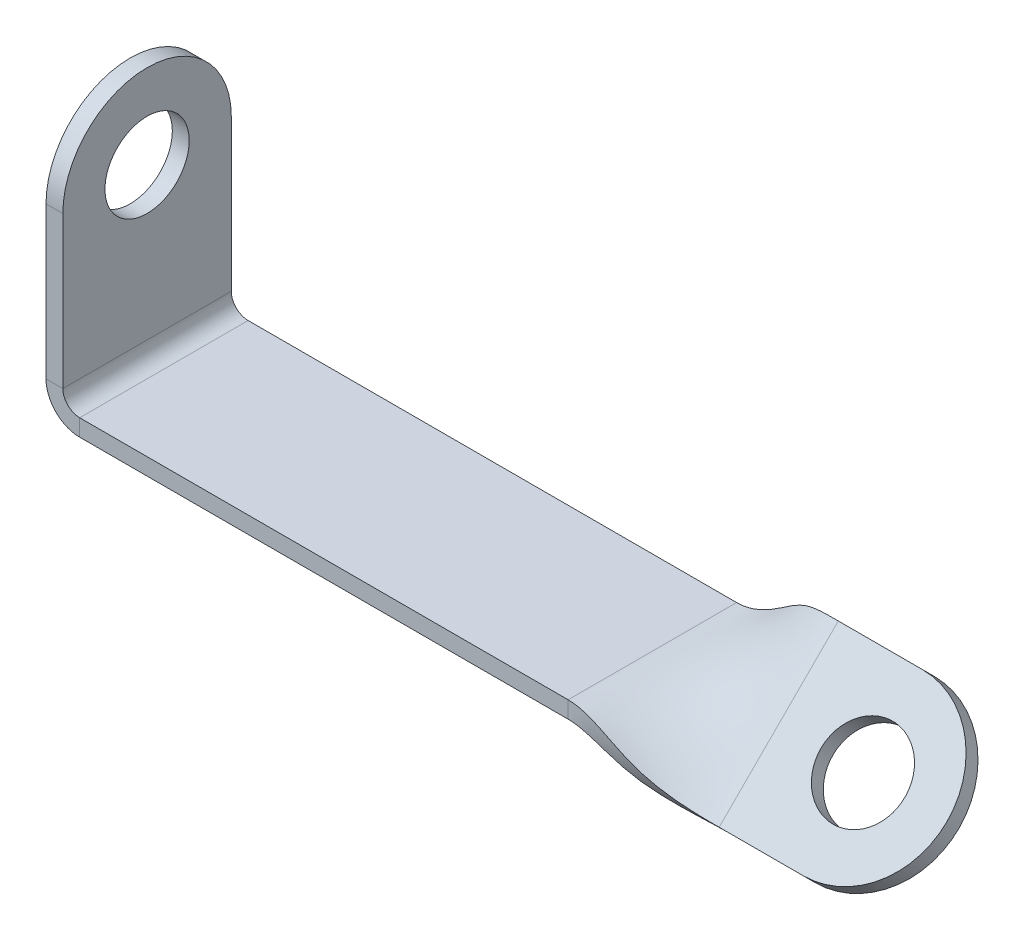
ISO-10303-21;
HEADER;
FILE_DESCRIPTION(('STEP AP214'),'2;1');
FILE_NAME('part.step','',(''),(''),'','','');
FILE_SCHEMA(('AUTOMOTIVE_DESIGN { 1 0 10303 214 1 1 1 1 }'));
ENDSEC;
DATA;
#1=APPLICATION_CONTEXT('core data for automotive mechanical design processes');
#2=APPLICATION_PROTOCOL_DEFINITION('international standard','automotive_design',2000,#1);
#3=PRODUCT_CONTEXT('',#1,'mechanical');
#4=PRODUCT('Part','Part','',(#3));
#5=PRODUCT_RELATED_PRODUCT_CATEGORY('part','',(#4));
#6=PRODUCT_DEFINITION_FORMATION('','',#4);
#7=PRODUCT_DEFINITION_CONTEXT('part definition',#1,'design');
#8=PRODUCT_DEFINITION('design','',#6,#7);
#9=PRODUCT_DEFINITION_SHAPE('','',#8);
#10=(LENGTH_UNIT() NAMED_UNIT(*) SI_UNIT(.MILLI.,.METRE.));
#11=(NAMED_UNIT(*) PLANE_ANGLE_UNIT() SI_UNIT($,.RADIAN.));
#12=(NAMED_UNIT(*) SI_UNIT($,.STERADIAN.) SOLID_ANGLE_UNIT());
#13=UNCERTAINTY_MEASURE_WITH_UNIT(LENGTH_MEASURE(1.E-05),#10,'distance_accuracy_value','');
#14=(GEOMETRIC_REPRESENTATION_CONTEXT(3) GLOBAL_UNCERTAINTY_ASSIGNED_CONTEXT((#13)) GLOBAL_UNIT_ASSIGNED_CONTEXT((#10,
#11,#12)) REPRESENTATION_CONTEXT('',''));
#15=CARTESIAN_POINT('',(0.,0.,0.));
#16=DIRECTION('',(0.,0.,1.));
#17=DIRECTION('',(1.,0.,0.));
#18=AXIS2_PLACEMENT_3D('',#15,#16,#17);
#19=CARTESIAN_POINT('',(10.,-1.41421356237309,-1.4142135623731));
#20=DIRECTION('',(0.,0.707106781186546,0.707106781186549));
#21=DIRECTION('',(0.,-0.707106781186549,0.707106781186546));
#22=AXIS2_PLACEMENT_3D('',#19,#20,#21);
#23=CYLINDRICAL_SURFACE('',#22,10.);
#24=DIRECTION('',(0.,0.707106781186546,0.707106781186549));
#25=VECTOR('',#24,1.);
#26=CARTESIAN_POINT('',(10.,-7.07106781186549,7.07106781186546));
#27=LINE('',#26,#25);
#28=CARTESIAN_POINT('',(10.,-8.48528137423858,5.65685424949236));
#29=VERTEX_POINT('',#28);
#30=CARTESIAN_POINT('',(10.,-7.07106781186549,7.07106781186546));
#31=VERTEX_POINT('',#30);
#32=EDGE_CURVE('E508',#29,#31,#27,.T.);
#33=ORIENTED_EDGE('',*,*,#32,.F.);
#34=CARTESIAN_POINT('',(10.,-1.41421356237309,-1.4142135623731));
#35=DIRECTION('',(0.,0.707106781186546,0.707106781186549));
#36=DIRECTION('',(0.,-0.707106781186549,0.707106781186546));
#37=AXIS2_PLACEMENT_3D('',#34,#35,#36);
#38=CIRCLE('',#37,10.);
#39=CARTESIAN_POINT('',(10.,5.6568542494924,-8.48528137423856));
#40=VERTEX_POINT('',#39);
#41=EDGE_CURVE('E160',#40,#29,#38,.F.);
#42=ORIENTED_EDGE('',*,*,#41,.F.);
#43=DIRECTION('',(0.,0.707106781186546,0.707106781186549));
#44=VECTOR('',#43,1.);
#45=CARTESIAN_POINT('',(10.,7.07106781186549,-7.07106781186546));
#46=LINE('',#45,#44);
#47=CARTESIAN_POINT('',(10.,7.07106781186549,-7.07106781186546));
#48=VERTEX_POINT('',#47);
#49=EDGE_CURVE('E511',#48,#40,#46,.F.);
#50=ORIENTED_EDGE('',*,*,#49,.F.);
#51=CARTESIAN_POINT('',(10.,0.,0.));
#52=DIRECTION('',(0.,0.707106781186546,0.707106781186549));
#53=DIRECTION('',(0.,-0.707106781186549,0.707106781186546));
#54=AXIS2_PLACEMENT_3D('',#51,#52,#53);
#55=CIRCLE('',#54,10.);
#56=EDGE_CURVE('E15',#31,#48,#55,.T.);
#57=ORIENTED_EDGE('',*,*,#56,.F.);
#58=EDGE_LOOP('',(#33,#42,#50,#57));
#59=FACE_BOUND('',#58,.T.);
#60=ADVANCED_FACE('F152',(#59),#23,.T.);
#61=CARTESIAN_POINT('',(-75.,20.,0.));
#62=DIRECTION('',(1.,0.,0.));
#63=DIRECTION('',(0.,0.,-1.));
#64=AXIS2_PLACEMENT_3D('',#61,#62,#63);
#65=CYLINDRICAL_SURFACE('',#64,10.);
#66=DIRECTION('',(1.,0.,0.));
#67=VECTOR('',#66,1.);
#68=CARTESIAN_POINT('',(-75.,20.,10.));
#69=LINE('',#68,#67);
#70=CARTESIAN_POINT('',(-75.,20.,10.));
#71=VERTEX_POINT('',#70);
#72=CARTESIAN_POINT('',(-77.,20.,10.));
#73=VERTEX_POINT('',#72);
#74=EDGE_CURVE('E260',#71,#73,#69,.F.);
#75=ORIENTED_EDGE('',*,*,#74,.F.);
#76=CARTESIAN_POINT('',(-75.,20.,0.));
#77=DIRECTION('',(1.,0.,0.));
#78=DIRECTION('',(0.,0.,-1.));
#79=AXIS2_PLACEMENT_3D('',#76,#77,#78);
#80=CIRCLE('',#79,10.);
#81=CARTESIAN_POINT('',(-75.,20.,-10.));
#82=VERTEX_POINT('',#81);
#83=EDGE_CURVE('E244',#82,#71,#80,.T.);
#84=ORIENTED_EDGE('',*,*,#83,.F.);
#85=DIRECTION('',(1.,0.,0.));
#86=VECTOR('',#85,1.);
#87=CARTESIAN_POINT('',(-75.,20.,-10.));
#88=LINE('',#87,#86);
#89=CARTESIAN_POINT('',(-77.,20.,-10.));
#90=VERTEX_POINT('',#89);
#91=EDGE_CURVE('E502',#90,#82,#88,.T.);
#92=ORIENTED_EDGE('',*,*,#91,.F.);
#93=CARTESIAN_POINT('',(-77.,20.,0.));
#94=DIRECTION('',(1.,0.,0.));
#95=DIRECTION('',(0.,0.,-1.));
#96=AXIS2_PLACEMENT_3D('',#93,#94,#95);
#97=CIRCLE('',#96,10.);
#98=EDGE_CURVE('E506',#73,#90,#97,.F.);
#99=ORIENTED_EDGE('',*,*,#98,.F.);
#100=EDGE_LOOP('',(#75,#84,#92,#99));
#101=FACE_BOUND('',#100,.T.);
#102=ADVANCED_FACE('F649',(#101),#65,.T.);
#103=CARTESIAN_POINT('',(-75.,30.,10.));
#104=DIRECTION('',(0.,0.,1.));
#105=DIRECTION('',(0.,-1.,0.));
#106=AXIS2_PLACEMENT_3D('',#103,#104,#105);
#107=PLANE('',#106);
#108=DIRECTION('',(0.,-1.,0.));
#109=VECTOR('',#108,1.);
#110=CARTESIAN_POINT('',(-75.,30.,10.));
#111=LINE('',#110,#109);
#112=CARTESIAN_POINT('',(-75.,2.,10.));
#113=VERTEX_POINT('',#112);
#114=EDGE_CURVE('E238',#71,#113,#111,.T.);
#115=ORIENTED_EDGE('',*,*,#114,.F.);
#116=ORIENTED_EDGE('',*,*,#74,.T.);
#117=DIRECTION('',(0.,1.,0.));
#118=VECTOR('',#117,1.);
#119=CARTESIAN_POINT('',(-77.,0.,10.));
#120=LINE('',#119,#118);
#121=CARTESIAN_POINT('',(-77.,2.,10.));
#122=VERTEX_POINT('',#121);
#123=EDGE_CURVE('E256',#73,#122,#120,.F.);
#124=ORIENTED_EDGE('',*,*,#123,.T.);
#125=DIRECTION('',(1.,0.,0.));
#126=VECTOR('',#125,1.);
#127=CARTESIAN_POINT('',(-75.,2.,10.));
#128=LINE('',#127,#126);
#129=EDGE_CURVE('E252',#122,#113,#128,.T.);
#130=ORIENTED_EDGE('',*,*,#129,.T.);
#131=EDGE_LOOP('',(#115,#116,#124,#130));
#132=FACE_BOUND('',#131,.T.);
#133=ADVANCED_FACE('F254',(#132),#107,.T.);
#134=CARTESIAN_POINT('',(-73.,1.99999999999999,10.));
#135=DIRECTION('',(0.,0.,-1.));
#136=DIRECTION('',(-1.,0.,0.));
#137=AXIS2_PLACEMENT_3D('',#134,#135,#136);
#138=PLANE('',#137);
#139=ORIENTED_EDGE('',*,*,#129,.F.);
#140=CARTESIAN_POINT('',(-73.,1.99999999999999,10.));
#141=DIRECTION('',(0.,0.,1.));
#142=DIRECTION('',(1.,0.,0.));
#143=AXIS2_PLACEMENT_3D('',#140,#141,#142);
#144=CIRCLE('',#143,4.);
#145=CARTESIAN_POINT('',(-73.,-2.00000000000001,10.));
#146=VERTEX_POINT('',#145);
#147=EDGE_CURVE('E293',#122,#146,#144,.T.);
#148=ORIENTED_EDGE('',*,*,#147,.T.);
#149=DIRECTION('',(0.,1.,0.));
#150=VECTOR('',#149,1.);
#151=CARTESIAN_POINT('',(-73.,0.,10.));
#152=LINE('',#151,#150);
#153=CARTESIAN_POINT('',(-73.,0.,10.));
#154=VERTEX_POINT('',#153);
#155=EDGE_CURVE('E261',#146,#154,#152,.T.);
#156=ORIENTED_EDGE('',*,*,#155,.T.);
#157=CARTESIAN_POINT('',(-73.,1.99999999999999,10.));
#158=DIRECTION('',(0.,0.,1.));
#159=DIRECTION('',(1.,0.,0.));
#160=AXIS2_PLACEMENT_3D('',#157,#158,#159);
#161=CIRCLE('',#160,2.);
#162=EDGE_CURVE('E264',#113,#154,#161,.T.);
#163=ORIENTED_EDGE('',*,*,#162,.F.);
#164=EDGE_LOOP('',(#139,#148,#156,#163));
#165=FACE_BOUND('',#164,.T.);
#166=ADVANCED_FACE('F265',(#165),#138,.F.);
#167=CARTESIAN_POINT('',(-73.,0.,10.));
#168=DIRECTION('',(0.,0.,1.));
#169=DIRECTION('',(1.,0.,0.));
#170=AXIS2_PLACEMENT_3D('',#167,#168,#169);
#171=PLANE('',#170);
#172=ORIENTED_EDGE('',*,*,#155,.F.);
#173=DIRECTION('',(-1.,0.,0.));
#174=VECTOR('',#173,1.);
#175=CARTESIAN_POINT('',(0.,-2.,10.));
#176=LINE('',#175,#174);
#177=CARTESIAN_POINT('',(-15.,-2.,10.));
#178=VERTEX_POINT('',#177);
#179=EDGE_CURVE('E309',#146,#178,#176,.F.);
#180=ORIENTED_EDGE('',*,*,#179,.T.);
#181=CARTESIAN_POINT('',(-15.,0.,10.));
#182=CARTESIAN_POINT('',(-15.,-2.,10.));
#183=B_SPLINE_CURVE_WITH_KNOTS('',1,(#181,#182),.UNSPECIFIED.,.F.,.F.,(2,2),(0.,1.),.UNSPECIFIED.);
#184=CARTESIAN_POINT('',(-15.,0.,10.));
#185=VERTEX_POINT('',#184);
#186=EDGE_CURVE('E482',#178,#185,#183,.F.);
#187=ORIENTED_EDGE('',*,*,#186,.T.);
#188=DIRECTION('',(1.,0.,0.));
#189=VECTOR('',#188,1.);
#190=CARTESIAN_POINT('',(-73.,0.,10.));
#191=LINE('',#190,#189);
#192=EDGE_CURVE('E315',#154,#185,#191,.T.);
#193=ORIENTED_EDGE('',*,*,#192,.F.);
#194=EDGE_LOOP('',(#172,#180,#187,#193));
#195=FACE_BOUND('',#194,.T.);
#196=ADVANCED_FACE('F440',(#195),#171,.T.);
#197=CARTESIAN_POINT('',(-15.,0.,10.));
#198=CARTESIAN_POINT('',(-14.3272882379867,0.,10.));
#199=CARTESIAN_POINT('',(-13.6724683867285,-0.128691710667785,9.99818927325916));
#200=CARTESIAN_POINT('',(-12.3896665503443,-0.570009559951335,9.96987481031682));
#201=CARTESIAN_POINT('',(-11.7616845652185,-0.882635698567101,9.94337107411534));
#202=CARTESIAN_POINT('',(-10.5236125057218,-1.61837341035903,9.84459903627275));
#203=CARTESIAN_POINT('',(-9.91352243135096,-2.0414849835352,9.77233073463166));
#204=CARTESIAN_POINT('',(-8.70228823798673,-2.92474457106034,9.56095800993092));
#205=CARTESIAN_POINT('',(-8.10114411899336,-3.38489258540932,9.42185358687127));
#206=CARTESIAN_POINT('',(-6.89885588100662,-4.2687760618925,9.05573706335445));
#207=CARTESIAN_POINT('',(-6.29771176201325,-4.69251152402671,8.82872496289729));
#208=CARTESIAN_POINT('',(-5.08647756864903,-5.46653345490754,8.353629206004));
#209=CARTESIAN_POINT('',(-4.47638749427818,-5.81681992365417,8.10554554956787));
#210=CARTESIAN_POINT('',(-3.23831543478149,-6.40690742658701,7.65514280213523));
#211=CARTESIAN_POINT('',(-2.61033344965566,-6.64670846077324,7.4528237111387));
#212=CARTESIAN_POINT('',(-1.32753161327155,-6.97878865341248,7.16078621600382));
#213=CARTESIAN_POINT('',(-0.672711762013262,-7.07106781186549,7.07106781186546));
#214=CARTESIAN_POINT('',(0.,-7.07106781186549,7.07106781186546));
#215=CARTESIAN_POINT('',(-15.,-2.,10.));
#216=CARTESIAN_POINT('',(-14.5847295667628,-2.,10.));
#217=CARTESIAN_POINT('',(-14.1533215730981,-2.07867684164917,9.9718164772912));
#218=CARTESIAN_POINT('',(-13.2119661737803,-2.39948253079803,9.86400082627915));
#219=CARTESIAN_POINT('',(-12.7042622019484,-2.6434931532367,9.78516283127311));
#220=CARTESIAN_POINT('',(-11.6379435009302,-3.26105480712674,9.5726327022108));
#221=CARTESIAN_POINT('',(-11.0804201269134,-3.63332274619514,9.43858979844773));
#222=CARTESIAN_POINT('',(-9.93479747112443,-4.43271541332017,9.09843705240721));
#223=CARTESIAN_POINT('',(-9.34646463053412,-4.85939816971557,8.89212310725338));
#224=CARTESIAN_POINT('',(-8.14417639254738,-5.6859849737919,8.38768018013308));
#225=CARTESIAN_POINT('',(-7.53022099515096,-6.08585963792613,8.08948026000968));
#226=CARTESIAN_POINT('',(-6.2533752642115,-6.82812321056842,7.46402040861353));
#227=CARTESIAN_POINT('',(-5.59071848948658,-7.17068031770725,7.13630363365408));
#228=CARTESIAN_POINT('',(-4.18089307151135,-7.76389179484011,6.52189867658881));
#229=CARTESIAN_POINT('',(-3.4326330730916,-8.01520541652071,6.23405517951978));
#230=CARTESIAN_POINT('',(-1.80838479964123,-8.37628474561014,5.80058688954173));
#231=CARTESIAN_POINT('',(-0.930153090789316,-8.48528137423858,5.65685424949236));
#232=CARTESIAN_POINT('',(0.,-8.48528137423858,5.65685424949236));
#233=B_SPLINE_SURFACE_WITH_KNOTS('',1,3,((#197,#198,#199,#200,#201,#202,#203,#204,#205,#206,
#207,#208,#209,#210,#211,#212,#213,#214),(#215,#216,#217,#218,#219,#220,#221,#222,#223,#224,
#225,#226,#227,#228,#229,#230,#231,#232)),.UNSPECIFIED.,.F.,.F.,.F.,(2,2),(4,2,2,2,2,2,2,2,4),
(0.,1.),(0.,0.125,0.25,0.375,0.5,0.625,0.75,0.875,1.),.UNSPECIFIED.);
#234=CARTESIAN_POINT('',(-15.,-2.,10.));
#235=CARTESIAN_POINT('',(-14.5847295667628,-2.,10.));
#236=CARTESIAN_POINT('',(-14.1533215730981,-2.07867684164917,9.9718164772912));
#237=CARTESIAN_POINT('',(-13.2119661737803,-2.39948253079803,9.86400082627915));
#238=CARTESIAN_POINT('',(-12.7042622019484,-2.6434931532367,9.78516283127311));
#239=CARTESIAN_POINT('',(-11.6379435009302,-3.26105480712674,9.5726327022108));
#240=CARTESIAN_POINT('',(-11.0804201269134,-3.63332274619514,9.43858979844773));
#241=CARTESIAN_POINT('',(-9.93479747112443,-4.43271541332017,9.09843705240721));
#242=CARTESIAN_POINT('',(-9.34646463053412,-4.85939816971557,8.89212310725338));
#243=CARTESIAN_POINT('',(-8.14417639254738,-5.6859849737919,8.38768018013308));
#244=CARTESIAN_POINT('',(-7.53022099515096,-6.08585963792613,8.08948026000968));
#245=CARTESIAN_POINT('',(-6.2533752642115,-6.82812321056842,7.46402040861353));
#246=CARTESIAN_POINT('',(-5.59071848948658,-7.17068031770725,7.13630363365408));
#247=CARTESIAN_POINT('',(-4.18089307151135,-7.76389179484011,6.52189867658881));
#248=CARTESIAN_POINT('',(-3.4326330730916,-8.01520541652071,6.23405517951978));
#249=CARTESIAN_POINT('',(-1.80838479964123,-8.37628474561014,5.80058688954173));
#250=CARTESIAN_POINT('',(-0.930153090789316,-8.48528137423858,5.65685424949236));
#251=CARTESIAN_POINT('',(0.,-8.48528137423858,5.65685424949236));
#252=B_SPLINE_CURVE_WITH_KNOTS('',3,(#234,#235,#236,#237,#238,#239,#240,#241,#242,#243,#244,
#245,#246,#247,#248,#249,#250,#251),.UNSPECIFIED.,.F.,.F.,(4,2,2,2,2,2,2,2,4),(0.,0.125,0.25,
0.375,0.5,0.625,0.75,0.875,1.),.UNSPECIFIED.);
#253=CARTESIAN_POINT('',(0.,-8.48528137423858,5.65685424949236));
#254=VERTEX_POINT('',#253);
#255=EDGE_CURVE('E404',#178,#254,#252,.T.);
#256=CARTESIAN_POINT('',(0.,-8.48528137423858,5.65685424949236));
#257=CARTESIAN_POINT('',(0.,-7.07106781186549,7.07106781186546));
#258=B_SPLINE_CURVE_WITH_KNOTS('',1,(#256,#257),.UNSPECIFIED.,.F.,.F.,(2,2),(0.,1.),.UNSPECIFIED.);
#259=CARTESIAN_POINT('',(0.,-7.07106781186549,7.07106781186546));
#260=VERTEX_POINT('',#259);
#261=EDGE_CURVE('E471',#254,#260,#258,.T.);
#262=CARTESIAN_POINT('',(-15.,0.,10.));
#263=CARTESIAN_POINT('',(-12.309152951947,0.,10.));
#264=CARTESIAN_POINT('',(-7.49999999999998,-4.11813474136907,9.942056744293));
#265=CARTESIAN_POINT('',(-2.69084704805305,-7.07106781186549,7.07106781186546));
#266=CARTESIAN_POINT('',(0.,-7.07106781186549,7.07106781186546));
#267=B_SPLINE_CURVE_WITH_KNOTS('',3,(#262,#263,#264,#265,#266),.UNSPECIFIED.,.F.,.F.,(4,1,4),
(0.,0.5,1.),.UNSPECIFIED.);
#268=EDGE_CURVE('E421',#185,#260,#267,.T.);
#269=ORIENTED_EDGE('',*,*,#186,.F.);
#270=ORIENTED_EDGE('',*,*,#255,.T.);
#271=ORIENTED_EDGE('',*,*,#261,.T.);
#272=ORIENTED_EDGE('',*,*,#268,.F.);
#273=EDGE_LOOP('',(#269,#270,#271,#272));
#274=FACE_BOUND('',#273,.T.);
#275=ADVANCED_FACE('F427',(#274),#233,.T.);
#276=CARTESIAN_POINT('',(0.,-7.07106781186549,7.07106781186546));
#277=DIRECTION('',(0.,-0.707106781186549,0.707106781186546));
#278=DIRECTION('',(1.,0.,0.));
#279=AXIS2_PLACEMENT_3D('',#276,#277,#278);
#280=PLANE('',#279);
#281=DIRECTION('',(1.,0.,0.));
#282=VECTOR('',#281,1.);
#283=CARTESIAN_POINT('',(0.,-8.48528137423858,5.65685424949236));
#284=LINE('',#283,#282);
#285=EDGE_CURVE('E275',#254,#29,#284,.T.);
#286=ORIENTED_EDGE('',*,*,#285,.T.);
#287=ORIENTED_EDGE('',*,*,#32,.T.);
#288=DIRECTION('',(1.,0.,0.));
#289=VECTOR('',#288,1.);
#290=CARTESIAN_POINT('',(0.,-7.07106781186549,7.07106781186546));
#291=LINE('',#290,#289);
#292=EDGE_CURVE('E628',#260,#31,#291,.T.);
#293=ORIENTED_EDGE('',*,*,#292,.F.);
#294=ORIENTED_EDGE('',*,*,#261,.F.);
#295=EDGE_LOOP('',(#286,#287,#293,#294));
#296=FACE_BOUND('',#295,.T.);
#297=ADVANCED_FACE('F439',(#296),#280,.T.);
#298=CARTESIAN_POINT('',(20.,7.07106781186549,-7.07106781186546));
#299=DIRECTION('',(0.,0.707106781186549,-0.707106781186546));
#300=DIRECTION('',(-1.,0.,0.));
#301=AXIS2_PLACEMENT_3D('',#298,#299,#300);
#302=PLANE('',#301);
#303=DIRECTION('',(-1.,0.,0.));
#304=VECTOR('',#303,1.);
#305=CARTESIAN_POINT('',(20.,7.07106781186549,-7.07106781186546));
#306=LINE('',#305,#304);
#307=CARTESIAN_POINT('',(0.,7.07106781186549,-7.07106781186546));
#308=VERTEX_POINT('',#307);
#309=EDGE_CURVE('E514',#48,#308,#306,.T.);
#310=ORIENTED_EDGE('',*,*,#309,.F.);
#311=ORIENTED_EDGE('',*,*,#49,.T.);
#312=DIRECTION('',(1.,0.,0.));
#313=VECTOR('',#312,1.);
#314=CARTESIAN_POINT('',(0.,5.6568542494924,-8.48528137423856));
#315=LINE('',#314,#313);
#316=CARTESIAN_POINT('',(0.,5.6568542494924,-8.48528137423856));
#317=VERTEX_POINT('',#316);
#318=EDGE_CURVE('E279',#40,#317,#315,.F.);
#319=ORIENTED_EDGE('',*,*,#318,.T.);
#320=CARTESIAN_POINT('',(0.,7.07106781186549,-7.07106781186546));
#321=CARTESIAN_POINT('',(0.,5.6568542494924,-8.48528137423856));
#322=B_SPLINE_CURVE_WITH_KNOTS('',1,(#320,#321),.UNSPECIFIED.,.F.,.F.,(2,2),(0.,1.),.UNSPECIFIED.);
#323=EDGE_CURVE('E583',#317,#308,#322,.F.);
#324=ORIENTED_EDGE('',*,*,#323,.T.);
#325=EDGE_LOOP('',(#310,#311,#319,#324));
#326=FACE_BOUND('',#325,.T.);
#327=ADVANCED_FACE('F543',(#326),#302,.T.);
#328=CARTESIAN_POINT('',(-15.,0.,-10.));
#329=CARTESIAN_POINT('',(-14.3272882379867,0.,-10.));
#330=CARTESIAN_POINT('',(-13.6724683867285,0.128691710667782,-9.99818927325916));
#331=CARTESIAN_POINT('',(-12.3896665503443,0.570009559951334,-9.96987481031682));
#332=CARTESIAN_POINT('',(-11.7616845652185,0.882635698567101,-9.94337107411534));
#333=CARTESIAN_POINT('',(-10.5236125057218,1.61837341035903,-9.84459903627276));
#334=CARTESIAN_POINT('',(-9.91352243135097,2.0414849835352,-9.77233073463167));
#335=CARTESIAN_POINT('',(-8.70228823798674,2.92474457106034,-9.56095800993093));
#336=CARTESIAN_POINT('',(-8.10114411899337,3.38489258540932,-9.42185358687128));
#337=CARTESIAN_POINT('',(-6.89885588100664,4.26877606189251,-9.05573706335446));
#338=CARTESIAN_POINT('',(-6.29771176201327,4.69251152402672,-8.82872496289729));
#339=CARTESIAN_POINT('',(-5.08647756864904,5.46653345490755,-8.353629206004));
#340=CARTESIAN_POINT('',(-4.47638749427819,5.81681992365417,-8.10554554956787));
#341=CARTESIAN_POINT('',(-3.2383154347815,6.40690742658702,-7.65514280213523));
#342=CARTESIAN_POINT('',(-2.61033344965567,6.64670846077324,-7.4528237111387));
#343=CARTESIAN_POINT('',(-1.32753161327155,6.97878865341248,-7.16078621600382));
#344=CARTESIAN_POINT('',(-0.672711762013263,7.07106781186549,-7.07106781186546));
#345=CARTESIAN_POINT('',(0.,7.07106781186549,-7.07106781186546));
#346=CARTESIAN_POINT('',(-15.,-2.,-10.));
#347=CARTESIAN_POINT('',(-14.0698469092107,-2.,-10.));
#348=CARTESIAN_POINT('',(-13.1916152003588,-1.8212934203136,-10.0245620692271));
#349=CARTESIAN_POINT('',(-11.5673669269084,-1.25946341089536,-10.0757487943545));
#350=CARTESIAN_POINT('',(-10.8191069284886,-0.878221756102495,-10.1015793169576));
#351=CARTESIAN_POINT('',(-9.40928151051341,-0.0243079864086764,-10.1165653703347));
#352=CARTESIAN_POINT('',(-8.74662473578849,0.449647220875253,-10.1060716708156));
#353=CARTESIAN_POINT('',(-7.46977900484904,1.41677372880051,-10.0234789674546));
#354=CARTESIAN_POINT('',(-6.85582360745261,1.91038700110307,-9.95158406648917));
#355=CARTESIAN_POINT('',(-5.65353536946587,2.85156714999311,-9.72379394657584));
#356=CARTESIAN_POINT('',(-5.06520252887556,3.29916341012729,-9.5679696657849));
#357=CARTESIAN_POINT('',(-3.91957987308657,4.10494369924667,-9.24323800339447));
#358=CARTESIAN_POINT('',(-3.36205649906978,4.46295952960109,-9.07478746548167));
#359=CARTESIAN_POINT('',(-2.29573779805164,5.04992305833392,-8.78838692768164));
#360=CARTESIAN_POINT('',(-1.78803382621974,5.27821150502577,-8.67159224275763));
#361=CARTESIAN_POINT('',(-0.846678426901874,5.58129256121482,-8.52098554246591));
#362=CARTESIAN_POINT('',(-0.415270433237211,5.6568542494924,-8.48528137423856));
#363=CARTESIAN_POINT('',(0.,5.6568542494924,-8.48528137423856));
#364=B_SPLINE_SURFACE_WITH_KNOTS('',1,3,((#328,#329,#330,#331,#332,#333,#334,#335,#336,#337,
#338,#339,#340,#341,#342,#343,#344,#345),(#346,#347,#348,#349,#350,#351,#352,#353,#354,#355,
#356,#357,#358,#359,#360,#361,#362,#363)),.UNSPECIFIED.,.F.,.F.,.F.,(2,2),(4,2,2,2,2,2,2,2,4),
(0.,1.),(0.,0.125,0.25,0.375,0.5,0.625,0.75,0.875,1.),.UNSPECIFIED.);
#365=CARTESIAN_POINT('',(0.,5.6568542494924,-8.48528137423856));
#366=CARTESIAN_POINT('',(-0.415270433237211,5.6568542494924,-8.48528137423856));
#367=CARTESIAN_POINT('',(-0.846678426901874,5.58129256121482,-8.52098554246591));
#368=CARTESIAN_POINT('',(-1.78803382621974,5.27821150502577,-8.67159224275763));
#369=CARTESIAN_POINT('',(-2.29573779805164,5.04992305833392,-8.78838692768164));
#370=CARTESIAN_POINT('',(-3.36205649906978,4.46295952960109,-9.07478746548167));
#371=CARTESIAN_POINT('',(-3.91957987308657,4.10494369924667,-9.24323800339447));
#372=CARTESIAN_POINT('',(-5.06520252887556,3.29916341012729,-9.5679696657849));
#373=CARTESIAN_POINT('',(-5.65353536946587,2.85156714999311,-9.72379394657584));
#374=CARTESIAN_POINT('',(-6.85582360745261,1.91038700110307,-9.95158406648917));
#375=CARTESIAN_POINT('',(-7.46977900484904,1.41677372880051,-10.0234789674546));
#376=CARTESIAN_POINT('',(-8.74662473578849,0.449647220875253,-10.1060716708156));
#377=CARTESIAN_POINT('',(-9.40928151051341,-0.0243079864086764,-10.1165653703347));
#378=CARTESIAN_POINT('',(-10.8191069284886,-0.878221756102495,-10.1015793169576));
#379=CARTESIAN_POINT('',(-11.5673669269084,-1.25946341089536,-10.0757487943545));
#380=CARTESIAN_POINT('',(-13.1916152003588,-1.8212934203136,-10.0245620692271));
#381=CARTESIAN_POINT('',(-14.0698469092107,-2.,-10.));
#382=CARTESIAN_POINT('',(-15.,-2.,-10.));
#383=B_SPLINE_CURVE_WITH_KNOTS('',3,(#365,#366,#367,#368,#369,#370,#371,#372,#373,#374,#375,
#376,#377,#378,#379,#380,#381,#382),.UNSPECIFIED.,.F.,.F.,(4,2,2,2,2,2,2,2,4),(0.,0.125,0.25,
0.375,0.5,0.625,0.75,0.875,1.),.UNSPECIFIED.);
#384=CARTESIAN_POINT('',(-15.,-2.,-10.));
#385=VERTEX_POINT('',#384);
#386=EDGE_CURVE('E415',#317,#385,#383,.T.);
#387=CARTESIAN_POINT('',(-15.,-2.,-10.));
#388=CARTESIAN_POINT('',(-15.,0.,-10.));
#389=B_SPLINE_CURVE_WITH_KNOTS('',1,(#387,#388),.UNSPECIFIED.,.F.,.F.,(2,2),(0.,1.),.UNSPECIFIED.);
#390=CARTESIAN_POINT('',(-15.,0.,-10.));
#391=VERTEX_POINT('',#390);
#392=EDGE_CURVE('E570',#385,#391,#389,.T.);
#393=CARTESIAN_POINT('',(0.,7.07106781186549,-7.07106781186546));
#394=CARTESIAN_POINT('',(-2.69084704805305,7.07106781186549,-7.07106781186546));
#395=CARTESIAN_POINT('',(-7.50000000000001,4.11813474136908,-9.94205674429301));
#396=CARTESIAN_POINT('',(-12.309152951947,0.,-10.));
#397=CARTESIAN_POINT('',(-15.,0.,-10.));
#398=B_SPLINE_CURVE_WITH_KNOTS('',3,(#393,#394,#395,#396,#397),.UNSPECIFIED.,.F.,.F.,(4,1,4),
(0.,0.5,1.),.UNSPECIFIED.);
#399=EDGE_CURVE('E329',#308,#391,#398,.T.);
#400=ORIENTED_EDGE('',*,*,#323,.F.);
#401=ORIENTED_EDGE('',*,*,#386,.T.);
#402=ORIENTED_EDGE('',*,*,#392,.T.);
#403=ORIENTED_EDGE('',*,*,#399,.F.);
#404=EDGE_LOOP('',(#400,#401,#402,#403));
#405=FACE_BOUND('',#404,.T.);
#406=ADVANCED_FACE('F531',(#405),#364,.F.);
#407=CARTESIAN_POINT('',(-15.,0.,-10.));
#408=DIRECTION('',(0.,0.,-1.));
#409=DIRECTION('',(-1.,0.,0.));
#410=AXIS2_PLACEMENT_3D('',#407,#408,#409);
#411=PLANE('',#410);
#412=ORIENTED_EDGE('',*,*,#392,.F.);
#413=DIRECTION('',(-1.,0.,0.));
#414=VECTOR('',#413,1.);
#415=CARTESIAN_POINT('',(0.,-2.,-10.));
#416=LINE('',#415,#414);
#417=CARTESIAN_POINT('',(-73.,-2.00000000000001,-10.));
#418=VERTEX_POINT('',#417);
#419=EDGE_CURVE('E304',#385,#418,#416,.T.);
#420=ORIENTED_EDGE('',*,*,#419,.T.);
#421=DIRECTION('',(0.,1.,0.));
#422=VECTOR('',#421,1.);
#423=CARTESIAN_POINT('',(-73.,0.,-10.));
#424=LINE('',#423,#422);
#425=CARTESIAN_POINT('',(-73.,0.,-10.));
#426=VERTEX_POINT('',#425);
#427=EDGE_CURVE('E631',#418,#426,#424,.T.);
#428=ORIENTED_EDGE('',*,*,#427,.T.);
#429=DIRECTION('',(-1.,0.,0.));
#430=VECTOR('',#429,1.);
#431=CARTESIAN_POINT('',(-15.,0.,-10.));
#432=LINE('',#431,#430);
#433=EDGE_CURVE('E312',#391,#426,#432,.T.);
#434=ORIENTED_EDGE('',*,*,#433,.F.);
#435=EDGE_LOOP('',(#412,#420,#428,#434));
#436=FACE_BOUND('',#435,.T.);
#437=ADVANCED_FACE('F542',(#436),#411,.T.);
#438=CARTESIAN_POINT('',(-73.,1.99999999999999,-10.));
#439=DIRECTION('',(0.,0.,-1.));
#440=DIRECTION('',(-1.,0.,0.));
#441=AXIS2_PLACEMENT_3D('',#438,#439,#440);
#442=PLANE('',#441);
#443=ORIENTED_EDGE('',*,*,#427,.F.);
#444=CARTESIAN_POINT('',(-73.,1.99999999999999,-10.));
#445=DIRECTION('',(0.,0.,1.));
#446=DIRECTION('',(1.,0.,0.));
#447=AXIS2_PLACEMENT_3D('',#444,#445,#446);
#448=CIRCLE('',#447,4.);
#449=CARTESIAN_POINT('',(-77.,1.99999999999999,-10.));
#450=VERTEX_POINT('',#449);
#451=EDGE_CURVE('E296',#450,#418,#448,.T.);
#452=ORIENTED_EDGE('',*,*,#451,.F.);
#453=DIRECTION('',(1.,0.,0.));
#454=VECTOR('',#453,1.);
#455=CARTESIAN_POINT('',(-75.,1.99999999999999,-10.));
#456=LINE('',#455,#454);
#457=CARTESIAN_POINT('',(-75.,1.99999999999999,-10.));
#458=VERTEX_POINT('',#457);
#459=EDGE_CURVE('E629',#450,#458,#456,.T.);
#460=ORIENTED_EDGE('',*,*,#459,.T.);
#461=CARTESIAN_POINT('',(-73.,1.99999999999999,-10.));
#462=DIRECTION('',(0.,0.,1.));
#463=DIRECTION('',(1.,0.,0.));
#464=AXIS2_PLACEMENT_3D('',#461,#462,#463);
#465=CIRCLE('',#464,2.);
#466=EDGE_CURVE('E269',#458,#426,#465,.T.);
#467=ORIENTED_EDGE('',*,*,#466,.T.);
#468=EDGE_LOOP('',(#443,#452,#460,#467));
#469=FACE_BOUND('',#468,.T.);
#470=ADVANCED_FACE('F639',(#469),#442,.T.);
#471=CARTESIAN_POINT('',(-75.,1.99999999999999,-10.));
#472=DIRECTION('',(0.,0.,-1.));
#473=DIRECTION('',(0.,1.,0.));
#474=AXIS2_PLACEMENT_3D('',#471,#472,#473);
#475=PLANE('',#474);
#476=DIRECTION('',(0.,1.,0.));
#477=VECTOR('',#476,1.);
#478=CARTESIAN_POINT('',(-77.,0.,-10.));
#479=LINE('',#478,#477);
#480=EDGE_CURVE('E288',#450,#90,#479,.T.);
#481=ORIENTED_EDGE('',*,*,#480,.T.);
#482=ORIENTED_EDGE('',*,*,#91,.T.);
#483=DIRECTION('',(0.,1.,0.));
#484=VECTOR('',#483,1.);
#485=CARTESIAN_POINT('',(-75.,1.99999999999999,-10.));
#486=LINE('',#485,#484);
#487=EDGE_CURVE('E249',#458,#82,#486,.T.);
#488=ORIENTED_EDGE('',*,*,#487,.F.);
#489=ORIENTED_EDGE('',*,*,#459,.F.);
#490=EDGE_LOOP('',(#481,#482,#488,#489));
#491=FACE_BOUND('',#490,.T.);
#492=ADVANCED_FACE('F641',(#491),#475,.T.);
#493=CARTESIAN_POINT('',(-75.,0.,0.));
#494=DIRECTION('',(1.,0.,0.));
#495=DIRECTION('',(0.,0.,-1.));
#496=AXIS2_PLACEMENT_3D('',#493,#494,#495);
#497=PLANE('',#496);
#498=CARTESIAN_POINT('',(-75.,20.,0.));
#499=DIRECTION('',(1.,0.,0.));
#500=DIRECTION('',(0.,0.,-1.));
#501=AXIS2_PLACEMENT_3D('',#498,#499,#500);
#502=CIRCLE('',#501,5.);
#503=CARTESIAN_POINT('',(-75.,20.,-5.));
#504=VERTEX_POINT('',#503);
#505=EDGE_CURVE('E884',#504,#504,#502,.T.);
#506=ORIENTED_EDGE('',*,*,#505,.F.);
#507=EDGE_LOOP('',(#506));
#508=FACE_BOUND('',#507,.T.);
#509=ORIENTED_EDGE('',*,*,#487,.T.);
#510=ORIENTED_EDGE('',*,*,#83,.T.);
#511=ORIENTED_EDGE('',*,*,#114,.T.);
#512=DIRECTION('',(0.,0.,-1.));
#513=VECTOR('',#512,1.);
#514=CARTESIAN_POINT('',(-75.,1.99999999999999,10.));
#515=LINE('',#514,#513);
#516=EDGE_CURVE('E243',#113,#458,#515,.T.);
#517=ORIENTED_EDGE('',*,*,#516,.T.);
#518=EDGE_LOOP('',(#509,#510,#511,#517));
#519=FACE_BOUND('',#518,.T.);
#520=ADVANCED_FACE('F241',(#508,#519),#497,.T.);
#521=CARTESIAN_POINT('',(-73.,1.99999999999999,10.));
#522=DIRECTION('',(0.,0.,1.));
#523=DIRECTION('',(1.,0.,0.));
#524=AXIS2_PLACEMENT_3D('',#521,#522,#523);
#525=CYLINDRICAL_SURFACE('',#524,2.);
#526=DIRECTION('',(0.,0.,-1.));
#527=VECTOR('',#526,1.);
#528=CARTESIAN_POINT('',(-73.,0.,10.));
#529=LINE('',#528,#527);
#530=EDGE_CURVE('E248',#154,#426,#529,.T.);
#531=ORIENTED_EDGE('',*,*,#530,.T.);
#532=ORIENTED_EDGE('',*,*,#466,.F.);
#533=ORIENTED_EDGE('',*,*,#516,.F.);
#534=ORIENTED_EDGE('',*,*,#162,.T.);
#535=EDGE_LOOP('',(#531,#532,#533,#534));
#536=FACE_BOUND('',#535,.T.);
#537=ADVANCED_FACE('F272',(#536),#525,.F.);
#538=CARTESIAN_POINT('',(0.,0.,0.));
#539=DIRECTION('',(0.,1.,0.));
#540=DIRECTION('',(-1.,0.,0.));
#541=AXIS2_PLACEMENT_3D('',#538,#539,#540);
#542=PLANE('',#541);
#543=DIRECTION('',(0.,0.,-1.));
#544=VECTOR('',#543,1.);
#545=CARTESIAN_POINT('',(-15.,0.,10.));
#546=LINE('',#545,#544);
#547=EDGE_CURVE('E283',#185,#391,#546,.T.);
#548=ORIENTED_EDGE('',*,*,#547,.T.);
#549=ORIENTED_EDGE('',*,*,#433,.T.);
#550=ORIENTED_EDGE('',*,*,#530,.F.);
#551=ORIENTED_EDGE('',*,*,#192,.T.);
#552=EDGE_LOOP('',(#548,#549,#550,#551));
#553=FACE_BOUND('',#552,.T.);
#554=ADVANCED_FACE('F349',(#553),#542,.T.);
#555=CARTESIAN_POINT('',(-15.,0.,10.));
#556=CARTESIAN_POINT('',(-15.,0.,-10.));
#557=CARTESIAN_POINT('',(-12.309152951947,0.,10.));
#558=CARTESIAN_POINT('',(-12.309152951947,0.,-10.));
#559=CARTESIAN_POINT('',(-7.49999999999998,-4.11813474136907,9.942056744293));
#560=CARTESIAN_POINT('',(-7.50000000000001,4.11813474136908,-9.94205674429301));
#561=CARTESIAN_POINT('',(-2.69084704805305,-7.07106781186549,7.07106781186546));
#562=CARTESIAN_POINT('',(-2.69084704805305,7.07106781186549,-7.07106781186546));
#563=CARTESIAN_POINT('',(0.,-7.07106781186549,7.07106781186546));
#564=CARTESIAN_POINT('',(0.,7.07106781186549,-7.07106781186546));
#565=B_SPLINE_SURFACE_WITH_KNOTS('',3,1,((#555,#556),(#557,#558),(#559,#560),(#561,#562),(#563,
#564)),.UNSPECIFIED.,.F.,.F.,.F.,(4,1,4),(2,2),(0.,0.5,1.),(0.,1.),.UNSPECIFIED.);
#566=DIRECTION('',(0.,0.707106781186549,-0.707106781186546));
#567=VECTOR('',#566,1.);
#568=CARTESIAN_POINT('',(0.,0.,0.));
#569=LINE('',#568,#567);
#570=EDGE_CURVE('E618',#260,#308,#569,.T.);
#571=ORIENTED_EDGE('',*,*,#268,.T.);
#572=ORIENTED_EDGE('',*,*,#570,.T.);
#573=ORIENTED_EDGE('',*,*,#399,.T.);
#574=ORIENTED_EDGE('',*,*,#547,.F.);
#575=EDGE_LOOP('',(#571,#572,#573,#574));
#576=FACE_BOUND('',#575,.T.);
#577=ADVANCED_FACE('F337',(#576),#565,.T.);
#578=CARTESIAN_POINT('',(0.,0.,0.));
#579=DIRECTION('',(0.,0.707106781186546,0.707106781186549));
#580=DIRECTION('',(0.,-0.707106781186549,0.707106781186546));
#581=AXIS2_PLACEMENT_3D('',#578,#579,#580);
#582=PLANE('',#581);
#583=CARTESIAN_POINT('',(10.,0.,0.));
#584=DIRECTION('',(0.,0.707106781186546,0.707106781186549));
#585=DIRECTION('',(0.,-0.707106781186549,0.707106781186546));
#586=AXIS2_PLACEMENT_3D('',#583,#584,#585);
#587=CIRCLE('',#586,5.);
#588=CARTESIAN_POINT('',(10.,-3.53553390593274,3.53553390593273));
#589=VERTEX_POINT('',#588);
#590=EDGE_CURVE('E889',#589,#589,#587,.T.);
#591=ORIENTED_EDGE('',*,*,#590,.F.);
#592=EDGE_LOOP('',(#591));
#593=FACE_BOUND('',#592,.T.);
#594=ORIENTED_EDGE('',*,*,#292,.T.);
#595=ORIENTED_EDGE('',*,*,#56,.T.);
#596=ORIENTED_EDGE('',*,*,#309,.T.);
#597=ORIENTED_EDGE('',*,*,#570,.F.);
#598=EDGE_LOOP('',(#594,#595,#596,#597));
#599=FACE_BOUND('',#598,.T.);
#600=ADVANCED_FACE('F348',(#593,#599),#582,.T.);
#601=CARTESIAN_POINT('',(-77.,0.,0.));
#602=DIRECTION('',(1.,0.,0.));
#603=DIRECTION('',(0.,0.,-1.));
#604=AXIS2_PLACEMENT_3D('',#601,#602,#603);
#605=PLANE('',#604);
#606=CARTESIAN_POINT('',(-77.,20.,0.));
#607=DIRECTION('',(1.,0.,0.));
#608=DIRECTION('',(0.,0.,-1.));
#609=AXIS2_PLACEMENT_3D('',#606,#607,#608);
#610=CIRCLE('',#609,5.);
#611=CARTESIAN_POINT('',(-77.,20.,-5.));
#612=VERTEX_POINT('',#611);
#613=EDGE_CURVE('E289',#612,#612,#610,.T.);
#614=ORIENTED_EDGE('',*,*,#613,.T.);
#615=EDGE_LOOP('',(#614));
#616=FACE_BOUND('',#615,.T.);
#617=ORIENTED_EDGE('',*,*,#123,.F.);
#618=ORIENTED_EDGE('',*,*,#98,.T.);
#619=ORIENTED_EDGE('',*,*,#480,.F.);
#620=DIRECTION('',(0.,0.,-1.));
#621=VECTOR('',#620,1.);
#622=CARTESIAN_POINT('',(-77.,2.,0.));
#623=LINE('',#622,#621);
#624=EDGE_CURVE('E285',#122,#450,#623,.T.);
#625=ORIENTED_EDGE('',*,*,#624,.F.);
#626=EDGE_LOOP('',(#617,#618,#619,#625));
#627=FACE_BOUND('',#626,.T.);
#628=ADVANCED_FACE('F716',(#616,#627),#605,.F.);
#629=CARTESIAN_POINT('',(-73.,1.99999999999999,10.));
#630=DIRECTION('',(0.,0.,1.));
#631=DIRECTION('',(1.,0.,0.));
#632=AXIS2_PLACEMENT_3D('',#629,#630,#631);
#633=CYLINDRICAL_SURFACE('',#632,4.);
#634=DIRECTION('',(0.,0.,1.));
#635=VECTOR('',#634,1.);
#636=CARTESIAN_POINT('',(-73.,-2.00000000000001,10.));
#637=LINE('',#636,#635);
#638=EDGE_CURVE('E290',#146,#418,#637,.F.);
#639=ORIENTED_EDGE('',*,*,#638,.F.);
#640=ORIENTED_EDGE('',*,*,#147,.F.);
#641=ORIENTED_EDGE('',*,*,#624,.T.);
#642=ORIENTED_EDGE('',*,*,#451,.T.);
#643=EDGE_LOOP('',(#639,#640,#641,#642));
#644=FACE_BOUND('',#643,.T.);
#645=ADVANCED_FACE('F710',(#644),#633,.T.);
#646=CARTESIAN_POINT('',(0.,-2.,0.));
#647=DIRECTION('',(0.,1.,0.));
#648=DIRECTION('',(-1.,0.,0.));
#649=AXIS2_PLACEMENT_3D('',#646,#647,#648);
#650=PLANE('',#649);
#651=DIRECTION('',(0.,0.,1.));
#652=VECTOR('',#651,1.);
#653=CARTESIAN_POINT('',(-15.,-2.,0.));
#654=LINE('',#653,#652);
#655=EDGE_CURVE('E299',#178,#385,#654,.F.);
#656=ORIENTED_EDGE('',*,*,#655,.F.);
#657=ORIENTED_EDGE('',*,*,#179,.F.);
#658=ORIENTED_EDGE('',*,*,#638,.T.);
#659=ORIENTED_EDGE('',*,*,#419,.F.);
#660=EDGE_LOOP('',(#656,#657,#658,#659));
#661=FACE_BOUND('',#660,.T.);
#662=ADVANCED_FACE('F715',(#661),#650,.F.);
#663=CARTESIAN_POINT('',(-15.,0.,10.));
#664=CARTESIAN_POINT('',(-15.,0.,-10.));
#665=CARTESIAN_POINT('',(-12.309152951947,0.,10.));
#666=CARTESIAN_POINT('',(-12.309152951947,0.,-10.));
#667=CARTESIAN_POINT('',(-7.49999999999998,-4.11813474136907,9.942056744293));
#668=CARTESIAN_POINT('',(-7.50000000000001,4.11813474136908,-9.94205674429301));
#669=CARTESIAN_POINT('',(-2.69084704805305,-7.07106781186549,7.07106781186546));
#670=CARTESIAN_POINT('',(-2.69084704805305,7.07106781186549,-7.07106781186546));
#671=CARTESIAN_POINT('',(0.,-7.07106781186549,7.07106781186546));
#672=CARTESIAN_POINT('',(0.,7.07106781186549,-7.07106781186546));
#673=B_SPLINE_SURFACE_WITH_KNOTS('',3,1,((#663,#664),(#665,#666),(#667,#668),(#669,#670),(#671,
#672)),.UNSPECIFIED.,.F.,.F.,.F.,(4,1,4),(2,2),(0.,0.5,1.),(0.,1.),.UNSPECIFIED.);
#674=OFFSET_SURFACE('',#673,-2.,.F.);
#675=ORIENTED_EDGE('',*,*,#255,.F.);
#676=ORIENTED_EDGE('',*,*,#655,.T.);
#677=ORIENTED_EDGE('',*,*,#386,.F.);
#678=CARTESIAN_POINT('',(0.,-8.48528137423859,5.65685424949237));
#679=CARTESIAN_POINT('',(0.,-7.8960257232498,5.06759859850358));
#680=CARTESIAN_POINT('',(0.,-7.306770072261,4.47834294751479));
#681=CARTESIAN_POINT('',(0.,-6.12825877028704,3.29983164554083));
#682=CARTESIAN_POINT('',(0.,-5.53900311930186,2.71057599455565));
#683=CARTESIAN_POINT('',(0.,-4.36049181731705,1.53206469257085));
#684=CARTESIAN_POINT('',(0.,-3.77123616631742,0.942809041571217));
#685=CARTESIAN_POINT('',(0.,-2.59272486433622,-0.235702260409974));
#686=CARTESIAN_POINT('',(0.,-2.00346921335466,-0.824957911391535));
#687=CARTESIAN_POINT('',(0.,-0.82495791139153,-2.00346921335466));
#688=CARTESIAN_POINT('',(0.,-0.235702260409967,-2.59272486433622));
#689=CARTESIAN_POINT('',(0.,0.942809041567615,-3.77123616631379));
#690=CARTESIAN_POINT('',(0.,1.53206469256363,-4.36049181730981));
#691=CARTESIAN_POINT('',(0.,2.71057599453399,-5.53900311928016));
#692=CARTESIAN_POINT('',(0.,3.29983164550832,-6.12825877025449));
#693=CARTESIAN_POINT('',(0.,4.47834294748591,-7.30677007223207));
#694=CARTESIAN_POINT('',(0.,5.06759859848915,-7.89602572323531));
#695=CARTESIAN_POINT('',(0.,5.6568542494924,-8.48528137423856));
#696=B_SPLINE_CURVE_WITH_KNOTS('',3,(#678,#679,#680,#681,#682,#683,#684,#685,#686,#687,#688,
#689,#690,#691,#692,#693,#694,#695),.UNSPECIFIED.,.F.,.F.,(4,2,2,2,2,2,2,2,4),(0.,2.5,
4.99999999998467,7.50000000003067,10.,12.4999999999693,15.,17.4999999999387,20.),.UNSPECIFIED.);
#697=EDGE_CURVE('E604',#254,#317,#696,.T.);
#698=ORIENTED_EDGE('',*,*,#697,.F.);
#699=EDGE_LOOP('',(#675,#676,#677,#698));
#700=FACE_BOUND('',#699,.T.);
#701=ADVANCED_FACE('F351',(#700),#674,.F.);
#702=CARTESIAN_POINT('',(0.,-1.41421356237309,-1.4142135623731));
#703=DIRECTION('',(0.,0.707106781186546,0.707106781186549));
#704=DIRECTION('',(0.,-0.707106781186549,0.707106781186546));
#705=AXIS2_PLACEMENT_3D('',#702,#703,#704);
#706=PLANE('',#705);
#707=CARTESIAN_POINT('',(10.,-1.41421356237309,-1.4142135623731));
#708=DIRECTION('',(0.,0.707106781186546,0.707106781186549));
#709=DIRECTION('',(0.,-0.707106781186549,0.707106781186546));
#710=AXIS2_PLACEMENT_3D('',#707,#708,#709);
#711=CIRCLE('',#710,5.);
#712=CARTESIAN_POINT('',(10.,-4.94974746830584,2.12132034355963));
#713=VERTEX_POINT('',#712);
#714=EDGE_CURVE('E885',#713,#713,#711,.T.);
#715=ORIENTED_EDGE('',*,*,#714,.T.);
#716=EDGE_LOOP('',(#715));
#717=FACE_BOUND('',#716,.T.);
#718=ORIENTED_EDGE('',*,*,#318,.F.);
#719=ORIENTED_EDGE('',*,*,#41,.T.);
#720=ORIENTED_EDGE('',*,*,#285,.F.);
#721=ORIENTED_EDGE('',*,*,#697,.T.);
#722=EDGE_LOOP('',(#718,#719,#720,#721));
#723=FACE_BOUND('',#722,.T.);
#724=ADVANCED_FACE('F605',(#717,#723),#706,.F.);
#725=CARTESIAN_POINT('',(-77.,20.,0.));
#726=DIRECTION('',(1.,0.,0.));
#727=DIRECTION('',(0.,0.,-1.));
#728=AXIS2_PLACEMENT_3D('',#725,#726,#727);
#729=CYLINDRICAL_SURFACE('',#728,5.);
#730=ORIENTED_EDGE('',*,*,#613,.F.);
#731=EDGE_LOOP('',(#730));
#732=FACE_BOUND('',#731,.T.);
#733=ORIENTED_EDGE('',*,*,#505,.T.);
#734=EDGE_LOOP('',(#733));
#735=FACE_BOUND('',#734,.T.);
#736=ADVANCED_FACE('F817',(#732,#735),#729,.F.);
#737=CARTESIAN_POINT('',(10.,-1.41421356237309,-1.4142135623731));
#738=DIRECTION('',(0.,0.707106781186546,0.707106781186549));
#739=DIRECTION('',(0.,-0.707106781186549,0.707106781186546));
#740=AXIS2_PLACEMENT_3D('',#737,#738,#739);
#741=CYLINDRICAL_SURFACE('',#740,5.);
#742=ORIENTED_EDGE('',*,*,#714,.F.);
#743=EDGE_LOOP('',(#742));
#744=FACE_BOUND('',#743,.T.);
#745=ORIENTED_EDGE('',*,*,#590,.T.);
#746=EDGE_LOOP('',(#745));
#747=FACE_BOUND('',#746,.T.);
#748=ADVANCED_FACE('F859',(#744,#747),#741,.F.);
#749=CLOSED_SHELL('',(#60,#102,#133,#166,#196,#275,#297,#327,#406,#437,#470,#492,#520,#537,#554,
#577,#600,#628,#645,#662,#701,#724,#736,#748));
#750=MANIFOLD_SOLID_BREP('B2',#749);
#751=ADVANCED_BREP_SHAPE_REPRESENTATION('',(#18,#750),#14);
#752=SHAPE_DEFINITION_REPRESENTATION(#9,#751);
ENDSEC;
END-ISO-10303-21;
